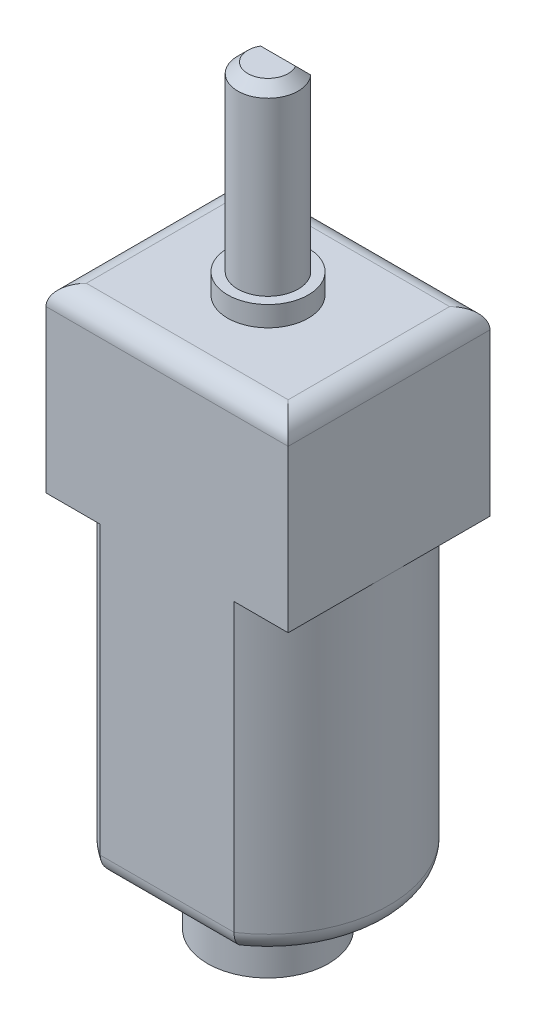
ISO-10303-21;
HEADER;
FILE_DESCRIPTION(('STEP AP214'),'2;1');
FILE_NAME('part.step','',(''),(''),'','','');
FILE_SCHEMA(('AUTOMOTIVE_DESIGN { 1 0 10303 214 1 1 1 1 }'));
ENDSEC;
DATA;
#1=APPLICATION_CONTEXT('core data for automotive mechanical design processes');
#2=APPLICATION_PROTOCOL_DEFINITION('international standard','automotive_design',2000,#1);
#3=PRODUCT_CONTEXT('',#1,'mechanical');
#4=PRODUCT('Part','Part','',(#3));
#5=PRODUCT_RELATED_PRODUCT_CATEGORY('part','',(#4));
#6=PRODUCT_DEFINITION_FORMATION('','',#4);
#7=PRODUCT_DEFINITION_CONTEXT('part definition',#1,'design');
#8=PRODUCT_DEFINITION('design','',#6,#7);
#9=PRODUCT_DEFINITION_SHAPE('','',#8);
#10=(LENGTH_UNIT() NAMED_UNIT(*) SI_UNIT(.MILLI.,.METRE.));
#11=(NAMED_UNIT(*) PLANE_ANGLE_UNIT() SI_UNIT($,.RADIAN.));
#12=(NAMED_UNIT(*) SI_UNIT($,.STERADIAN.) SOLID_ANGLE_UNIT());
#13=UNCERTAINTY_MEASURE_WITH_UNIT(LENGTH_MEASURE(1.E-05),#10,'distance_accuracy_value','');
#14=(GEOMETRIC_REPRESENTATION_CONTEXT(3) GLOBAL_UNCERTAINTY_ASSIGNED_CONTEXT((#13)) GLOBAL_UNIT_ASSIGNED_CONTEXT((#10,
#11,#12)) REPRESENTATION_CONTEXT('',''));
#15=CARTESIAN_POINT('',(0.,0.,0.));
#16=DIRECTION('',(0.,0.,1.));
#17=DIRECTION('',(1.,0.,0.));
#18=AXIS2_PLACEMENT_3D('',#15,#16,#17);
#19=CARTESIAN_POINT('',(0.,15.2,0.));
#20=DIRECTION('',(0.,-1.,0.));
#21=DIRECTION('',(0.,0.,-1.));
#22=AXIS2_PLACEMENT_3D('',#19,#20,#21);
#23=CYLINDRICAL_SURFACE('',#22,6.);
#24=DIRECTION('',(0.,-1.,0.));
#25=VECTOR('',#24,1.);
#26=CARTESIAN_POINT('',(-3.3166247903554,15.2,-5.));
#27=LINE('',#26,#25);
#28=CARTESIAN_POINT('',(-3.3166247903554,15.2,-5.));
#29=VERTEX_POINT('',#28);
#30=CARTESIAN_POINT('',(-3.3166247903554,1.,-5.));
#31=VERTEX_POINT('',#30);
#32=EDGE_CURVE('E240',#29,#31,#27,.T.);
#33=ORIENTED_EDGE('',*,*,#32,.T.);
#34=CARTESIAN_POINT('',(0.,0.999999999999999,0.));
#35=DIRECTION('',(0.,1.,0.));
#36=DIRECTION('',(0.,0.,1.));
#37=AXIS2_PLACEMENT_3D('',#34,#35,#36);
#38=CIRCLE('',#37,6.);
#39=CARTESIAN_POINT('',(-3.3166247903554,1.,5.));
#40=VERTEX_POINT('',#39);
#41=EDGE_CURVE('E473',#31,#40,#38,.T.);
#42=ORIENTED_EDGE('',*,*,#41,.T.);
#43=DIRECTION('',(0.,-1.,0.));
#44=VECTOR('',#43,1.);
#45=CARTESIAN_POINT('',(-3.3166247903554,15.2,5.));
#46=LINE('',#45,#44);
#47=CARTESIAN_POINT('',(-3.3166247903554,15.2,5.));
#48=VERTEX_POINT('',#47);
#49=EDGE_CURVE('E198',#48,#40,#46,.T.);
#50=ORIENTED_EDGE('',*,*,#49,.F.);
#51=CARTESIAN_POINT('',(0.,15.2,0.));
#52=DIRECTION('',(0.,1.,0.));
#53=DIRECTION('',(0.,0.,1.));
#54=AXIS2_PLACEMENT_3D('',#51,#52,#53);
#55=CIRCLE('',#54,6.);
#56=CARTESIAN_POINT('',(-6.,15.2,0.));
#57=VERTEX_POINT('',#56);
#58=EDGE_CURVE('E230',#57,#48,#55,.T.);
#59=ORIENTED_EDGE('',*,*,#58,.F.);
#60=EDGE_CURVE('E231',#29,#57,#55,.T.);
#61=ORIENTED_EDGE('',*,*,#60,.F.);
#62=EDGE_LOOP('',(#33,#42,#50,#59,#61));
#63=FACE_BOUND('',#62,.T.);
#64=ADVANCED_FACE('F40',(#63),#23,.T.);
#65=CARTESIAN_POINT('',(-3.3166247903554,15.2,5.));
#66=DIRECTION('',(0.,0.,-1.));
#67=DIRECTION('',(-1.,0.,0.));
#68=AXIS2_PLACEMENT_3D('',#65,#66,#67);
#69=PLANE('',#68);
#70=ORIENTED_EDGE('',*,*,#49,.T.);
#71=DIRECTION('',(1.,0.,0.));
#72=VECTOR('',#71,1.);
#73=CARTESIAN_POINT('',(-3.3166247903554,0.999999999999999,5.));
#74=LINE('',#73,#72);
#75=CARTESIAN_POINT('',(3.3166247903554,1.,5.));
#76=VERTEX_POINT('',#75);
#77=EDGE_CURVE('E446',#40,#76,#74,.T.);
#78=ORIENTED_EDGE('',*,*,#77,.T.);
#79=DIRECTION('',(0.,-1.,0.));
#80=VECTOR('',#79,1.);
#81=CARTESIAN_POINT('',(3.3166247903554,15.2,5.));
#82=LINE('',#81,#80);
#83=CARTESIAN_POINT('',(3.3166247903554,15.2,5.));
#84=VERTEX_POINT('',#83);
#85=EDGE_CURVE('E248',#84,#76,#82,.T.);
#86=ORIENTED_EDGE('',*,*,#85,.F.);
#87=DIRECTION('',(1.,0.,0.));
#88=VECTOR('',#87,1.);
#89=CARTESIAN_POINT('',(6.,15.2,5.));
#90=LINE('',#89,#88);
#91=CARTESIAN_POINT('',(6.,15.2,5.));
#92=VERTEX_POINT('',#91);
#93=EDGE_CURVE('E203',#84,#92,#90,.T.);
#94=ORIENTED_EDGE('',*,*,#93,.T.);
#95=DIRECTION('',(0.,-1.,0.));
#96=VECTOR('',#95,1.);
#97=CARTESIAN_POINT('',(6.,24.2,5.));
#98=LINE('',#97,#96);
#99=CARTESIAN_POINT('',(6.,23.2,5.));
#100=VERTEX_POINT('',#99);
#101=EDGE_CURVE('E224',#100,#92,#98,.T.);
#102=ORIENTED_EDGE('',*,*,#101,.F.);
#103=DIRECTION('',(1.,0.,0.));
#104=VECTOR('',#103,1.);
#105=CARTESIAN_POINT('',(-3.3166247903554,23.2,5.));
#106=LINE('',#105,#104);
#107=CARTESIAN_POINT('',(-6.,23.2,5.));
#108=VERTEX_POINT('',#107);
#109=EDGE_CURVE('E266',#100,#108,#106,.F.);
#110=ORIENTED_EDGE('',*,*,#109,.T.);
#111=DIRECTION('',(0.,-1.,0.));
#112=VECTOR('',#111,1.);
#113=CARTESIAN_POINT('',(-6.,24.2,5.));
#114=LINE('',#113,#112);
#115=CARTESIAN_POINT('',(-6.,15.2,5.));
#116=VERTEX_POINT('',#115);
#117=EDGE_CURVE('E227',#108,#116,#114,.T.);
#118=ORIENTED_EDGE('',*,*,#117,.T.);
#119=EDGE_CURVE('E204',#116,#48,#90,.T.);
#120=ORIENTED_EDGE('',*,*,#119,.T.);
#121=EDGE_LOOP('',(#70,#78,#86,#94,#102,#110,#118,#120));
#122=FACE_BOUND('',#121,.T.);
#123=ADVANCED_FACE('F346',(#122),#69,.F.);
#124=CARTESIAN_POINT('',(0.,15.2,0.));
#125=DIRECTION('',(0.,-1.,0.));
#126=DIRECTION('',(0.,0.,-1.));
#127=AXIS2_PLACEMENT_3D('',#124,#125,#126);
#128=CYLINDRICAL_SURFACE('',#127,6.);
#129=ORIENTED_EDGE('',*,*,#85,.T.);
#130=CARTESIAN_POINT('',(0.,0.999999999999999,0.));
#131=DIRECTION('',(0.,1.,0.));
#132=DIRECTION('',(0.,0.,1.));
#133=AXIS2_PLACEMENT_3D('',#130,#131,#132);
#134=CIRCLE('',#133,6.);
#135=CARTESIAN_POINT('',(3.3166247903554,1.,-5.));
#136=VERTEX_POINT('',#135);
#137=EDGE_CURVE('E459',#76,#136,#134,.T.);
#138=ORIENTED_EDGE('',*,*,#137,.T.);
#139=DIRECTION('',(0.,-1.,0.));
#140=VECTOR('',#139,1.);
#141=CARTESIAN_POINT('',(3.3166247903554,15.2,-5.));
#142=LINE('',#141,#140);
#143=CARTESIAN_POINT('',(3.3166247903554,15.2,-5.));
#144=VERTEX_POINT('',#143);
#145=EDGE_CURVE('E244',#144,#136,#142,.T.);
#146=ORIENTED_EDGE('',*,*,#145,.F.);
#147=CARTESIAN_POINT('',(0.,15.2,0.));
#148=DIRECTION('',(0.,1.,0.));
#149=DIRECTION('',(0.,0.,1.));
#150=AXIS2_PLACEMENT_3D('',#147,#148,#149);
#151=CIRCLE('',#150,6.);
#152=CARTESIAN_POINT('',(6.,15.2,0.));
#153=VERTEX_POINT('',#152);
#154=EDGE_CURVE('E235',#153,#144,#151,.T.);
#155=ORIENTED_EDGE('',*,*,#154,.F.);
#156=EDGE_CURVE('E236',#84,#153,#151,.T.);
#157=ORIENTED_EDGE('',*,*,#156,.F.);
#158=EDGE_LOOP('',(#129,#138,#146,#155,#157));
#159=FACE_BOUND('',#158,.T.);
#160=ADVANCED_FACE('F351',(#159),#128,.T.);
#161=CARTESIAN_POINT('',(-3.3166247903554,15.2,-5.));
#162=DIRECTION('',(0.,0.,1.));
#163=DIRECTION('',(1.,0.,0.));
#164=AXIS2_PLACEMENT_3D('',#161,#162,#163);
#165=PLANE('',#164);
#166=ORIENTED_EDGE('',*,*,#145,.T.);
#167=DIRECTION('',(-1.,0.,0.));
#168=VECTOR('',#167,1.);
#169=CARTESIAN_POINT('',(-3.3166247903554,0.999999999999999,-5.));
#170=LINE('',#169,#168);
#171=EDGE_CURVE('E471',#136,#31,#170,.T.);
#172=ORIENTED_EDGE('',*,*,#171,.T.);
#173=ORIENTED_EDGE('',*,*,#32,.F.);
#174=DIRECTION('',(-1.,0.,0.));
#175=VECTOR('',#174,1.);
#176=CARTESIAN_POINT('',(6.,15.2,-5.));
#177=LINE('',#176,#175);
#178=CARTESIAN_POINT('',(-6.,15.2,-5.));
#179=VERTEX_POINT('',#178);
#180=EDGE_CURVE('E213',#29,#179,#177,.T.);
#181=ORIENTED_EDGE('',*,*,#180,.T.);
#182=DIRECTION('',(0.,-1.,0.));
#183=VECTOR('',#182,1.);
#184=CARTESIAN_POINT('',(-6.,24.2,-5.));
#185=LINE('',#184,#183);
#186=CARTESIAN_POINT('',(-6.,23.2,-5.));
#187=VERTEX_POINT('',#186);
#188=EDGE_CURVE('E218',#187,#179,#185,.T.);
#189=ORIENTED_EDGE('',*,*,#188,.F.);
#190=DIRECTION('',(-1.,0.,0.));
#191=VECTOR('',#190,1.);
#192=CARTESIAN_POINT('',(-3.3166247903554,23.2,-5.));
#193=LINE('',#192,#191);
#194=CARTESIAN_POINT('',(6.,23.2,-5.));
#195=VERTEX_POINT('',#194);
#196=EDGE_CURVE('E463',#187,#195,#193,.F.);
#197=ORIENTED_EDGE('',*,*,#196,.T.);
#198=DIRECTION('',(0.,-1.,0.));
#199=VECTOR('',#198,1.);
#200=CARTESIAN_POINT('',(6.,24.2,-5.));
#201=LINE('',#200,#199);
#202=CARTESIAN_POINT('',(6.,15.2,-5.));
#203=VERTEX_POINT('',#202);
#204=EDGE_CURVE('E221',#195,#203,#201,.T.);
#205=ORIENTED_EDGE('',*,*,#204,.T.);
#206=EDGE_CURVE('E214',#203,#144,#177,.T.);
#207=ORIENTED_EDGE('',*,*,#206,.T.);
#208=EDGE_LOOP('',(#166,#172,#173,#181,#189,#197,#205,#207));
#209=FACE_BOUND('',#208,.T.);
#210=ADVANCED_FACE('F357',(#209),#165,.F.);
#211=CARTESIAN_POINT('',(0.,0.,0.));
#212=DIRECTION('',(0.,1.,0.));
#213=DIRECTION('',(0.,0.,1.));
#214=AXIS2_PLACEMENT_3D('',#211,#212,#213);
#215=PLANE('',#214);
#216=CARTESIAN_POINT('',(0.,0.,0.));
#217=DIRECTION('',(0.,1.,0.));
#218=DIRECTION('',(0.,0.,1.));
#219=AXIS2_PLACEMENT_3D('',#216,#217,#218);
#220=CIRCLE('',#219,3.);
#221=CARTESIAN_POINT('',(0.,0.,3.));
#222=VERTEX_POINT('',#221);
#223=EDGE_CURVE('E11',#222,#222,#220,.F.);
#224=ORIENTED_EDGE('',*,*,#223,.F.);
#225=EDGE_LOOP('',(#224));
#226=FACE_BOUND('',#225,.T.);
#227=CARTESIAN_POINT('',(0.,0.,0.));
#228=DIRECTION('',(0.,1.,0.));
#229=DIRECTION('',(0.,0.,1.));
#230=AXIS2_PLACEMENT_3D('',#227,#228,#229);
#231=CIRCLE('',#230,5.);
#232=CARTESIAN_POINT('',(3.,0.,-4.));
#233=VERTEX_POINT('',#232);
#234=CARTESIAN_POINT('',(3.,0.,4.));
#235=VERTEX_POINT('',#234);
#236=EDGE_CURVE('E458',#233,#235,#231,.F.);
#237=ORIENTED_EDGE('',*,*,#236,.T.);
#238=DIRECTION('',(1.,0.,0.));
#239=VECTOR('',#238,1.);
#240=CARTESIAN_POINT('',(0.,0.,4.));
#241=LINE('',#240,#239);
#242=CARTESIAN_POINT('',(-3.,0.,4.));
#243=VERTEX_POINT('',#242);
#244=EDGE_CURVE('E444',#235,#243,#241,.F.);
#245=ORIENTED_EDGE('',*,*,#244,.T.);
#246=CARTESIAN_POINT('',(0.,0.,0.));
#247=DIRECTION('',(0.,1.,0.));
#248=DIRECTION('',(0.,0.,1.));
#249=AXIS2_PLACEMENT_3D('',#246,#247,#248);
#250=CIRCLE('',#249,5.);
#251=CARTESIAN_POINT('',(-3.,0.,-4.));
#252=VERTEX_POINT('',#251);
#253=EDGE_CURVE('E450',#243,#252,#250,.F.);
#254=ORIENTED_EDGE('',*,*,#253,.T.);
#255=DIRECTION('',(-1.,0.,0.));
#256=VECTOR('',#255,1.);
#257=CARTESIAN_POINT('',(0.,0.,-4.));
#258=LINE('',#257,#256);
#259=EDGE_CURVE('E455',#252,#233,#258,.F.);
#260=ORIENTED_EDGE('',*,*,#259,.T.);
#261=EDGE_LOOP('',(#237,#245,#254,#260));
#262=FACE_BOUND('',#261,.T.);
#263=ADVANCED_FACE('F361',(#226,#262),#215,.F.);
#264=CARTESIAN_POINT('',(0.,15.2,0.));
#265=DIRECTION('',(0.,-1.,0.));
#266=DIRECTION('',(0.,0.,-1.));
#267=AXIS2_PLACEMENT_3D('',#264,#265,#266);
#268=PLANE('',#267);
#269=ORIENTED_EDGE('',*,*,#180,.F.);
#270=ORIENTED_EDGE('',*,*,#60,.T.);
#271=DIRECTION('',(0.,0.,1.));
#272=VECTOR('',#271,1.);
#273=CARTESIAN_POINT('',(-6.,15.2,-5.));
#274=LINE('',#273,#272);
#275=EDGE_CURVE('E199',#179,#57,#274,.T.);
#276=ORIENTED_EDGE('',*,*,#275,.F.);
#277=EDGE_LOOP('',(#269,#270,#276));
#278=FACE_BOUND('',#277,.T.);
#279=ADVANCED_FACE('F365',(#278),#268,.T.);
#280=EDGE_CURVE('E194',#57,#116,#274,.T.);
#281=ORIENTED_EDGE('',*,*,#280,.F.);
#282=ORIENTED_EDGE('',*,*,#58,.T.);
#283=ORIENTED_EDGE('',*,*,#119,.F.);
#284=EDGE_LOOP('',(#281,#282,#283));
#285=FACE_BOUND('',#284,.T.);
#286=ADVANCED_FACE('F524',(#285),#268,.T.);
#287=ORIENTED_EDGE('',*,*,#93,.F.);
#288=ORIENTED_EDGE('',*,*,#156,.T.);
#289=DIRECTION('',(0.,0.,-1.));
#290=VECTOR('',#289,1.);
#291=CARTESIAN_POINT('',(6.,15.2,-5.));
#292=LINE('',#291,#290);
#293=EDGE_CURVE('E209',#92,#153,#292,.T.);
#294=ORIENTED_EDGE('',*,*,#293,.F.);
#295=EDGE_LOOP('',(#287,#288,#294));
#296=FACE_BOUND('',#295,.T.);
#297=ADVANCED_FACE('F371',(#296),#268,.T.);
#298=CARTESIAN_POINT('',(-6.,24.2,-5.));
#299=DIRECTION('',(1.,0.,0.));
#300=DIRECTION('',(0.,0.,-1.));
#301=AXIS2_PLACEMENT_3D('',#298,#299,#300);
#302=PLANE('',#301);
#303=ORIENTED_EDGE('',*,*,#117,.F.);
#304=DIRECTION('',(0.,0.,1.));
#305=VECTOR('',#304,1.);
#306=CARTESIAN_POINT('',(-6.,23.2,-5.));
#307=LINE('',#306,#305);
#308=EDGE_CURVE('E487',#108,#187,#307,.F.);
#309=ORIENTED_EDGE('',*,*,#308,.T.);
#310=ORIENTED_EDGE('',*,*,#188,.T.);
#311=ORIENTED_EDGE('',*,*,#275,.T.);
#312=ORIENTED_EDGE('',*,*,#280,.T.);
#313=EDGE_LOOP('',(#303,#309,#310,#311,#312));
#314=FACE_BOUND('',#313,.T.);
#315=ADVANCED_FACE('F367',(#314),#302,.F.);
#316=CARTESIAN_POINT('',(6.,24.2,-5.));
#317=DIRECTION('',(-1.,0.,0.));
#318=DIRECTION('',(0.,0.,1.));
#319=AXIS2_PLACEMENT_3D('',#316,#317,#318);
#320=PLANE('',#319);
#321=ORIENTED_EDGE('',*,*,#204,.F.);
#322=DIRECTION('',(0.,0.,-1.));
#323=VECTOR('',#322,1.);
#324=CARTESIAN_POINT('',(6.,23.2,-5.));
#325=LINE('',#324,#323);
#326=EDGE_CURVE('E49',#195,#100,#325,.F.);
#327=ORIENTED_EDGE('',*,*,#326,.T.);
#328=ORIENTED_EDGE('',*,*,#101,.T.);
#329=ORIENTED_EDGE('',*,*,#293,.T.);
#330=EDGE_CURVE('E208',#153,#203,#292,.T.);
#331=ORIENTED_EDGE('',*,*,#330,.T.);
#332=EDGE_LOOP('',(#321,#327,#328,#329,#331));
#333=FACE_BOUND('',#332,.T.);
#334=ADVANCED_FACE('F370',(#333),#320,.F.);
#335=CARTESIAN_POINT('',(0.,24.2,0.));
#336=DIRECTION('',(0.,-1.,0.));
#337=DIRECTION('',(0.,0.,-1.));
#338=AXIS2_PLACEMENT_3D('',#335,#336,#337);
#339=PLANE('',#338);
#340=DIRECTION('',(0.,0.,-1.));
#341=VECTOR('',#340,1.);
#342=CARTESIAN_POINT('',(5.,24.2,0.));
#343=LINE('',#342,#341);
#344=CARTESIAN_POINT('',(5.,24.2,4.));
#345=VERTEX_POINT('',#344);
#346=CARTESIAN_POINT('',(5.,24.2,-4.));
#347=VERTEX_POINT('',#346);
#348=EDGE_CURVE('E476',#345,#347,#343,.T.);
#349=ORIENTED_EDGE('',*,*,#348,.T.);
#350=DIRECTION('',(-1.,0.,0.));
#351=VECTOR('',#350,1.);
#352=CARTESIAN_POINT('',(0.,24.2,-4.));
#353=LINE('',#352,#351);
#354=CARTESIAN_POINT('',(-5.,24.2,-4.));
#355=VERTEX_POINT('',#354);
#356=EDGE_CURVE('E484',#347,#355,#353,.T.);
#357=ORIENTED_EDGE('',*,*,#356,.T.);
#358=DIRECTION('',(0.,0.,1.));
#359=VECTOR('',#358,1.);
#360=CARTESIAN_POINT('',(-5.,24.2,0.));
#361=LINE('',#360,#359);
#362=CARTESIAN_POINT('',(-5.,24.2,4.));
#363=VERTEX_POINT('',#362);
#364=EDGE_CURVE('E63',#355,#363,#361,.T.);
#365=ORIENTED_EDGE('',*,*,#364,.T.);
#366=DIRECTION('',(1.,0.,0.));
#367=VECTOR('',#366,1.);
#368=CARTESIAN_POINT('',(0.,24.2,4.));
#369=LINE('',#368,#367);
#370=EDGE_CURVE('E479',#363,#345,#369,.T.);
#371=ORIENTED_EDGE('',*,*,#370,.T.);
#372=EDGE_LOOP('',(#349,#357,#365,#371));
#373=FACE_BOUND('',#372,.T.);
#374=CARTESIAN_POINT('',(0.,24.2,0.));
#375=DIRECTION('',(0.,1.,0.));
#376=DIRECTION('',(0.,0.,1.));
#377=AXIS2_PLACEMENT_3D('',#374,#375,#376);
#378=CIRCLE('',#377,2.);
#379=CARTESIAN_POINT('',(0.,24.2,2.));
#380=VERTEX_POINT('',#379);
#381=EDGE_CURVE('E190',#380,#380,#378,.T.);
#382=ORIENTED_EDGE('',*,*,#381,.F.);
#383=EDGE_LOOP('',(#382));
#384=FACE_BOUND('',#383,.T.);
#385=ADVANCED_FACE('F375',(#373,#384),#339,.F.);
#386=ORIENTED_EDGE('',*,*,#330,.F.);
#387=ORIENTED_EDGE('',*,*,#154,.T.);
#388=ORIENTED_EDGE('',*,*,#206,.F.);
#389=EDGE_LOOP('',(#386,#387,#388));
#390=FACE_BOUND('',#389,.T.);
#391=ADVANCED_FACE('F377',(#390),#268,.T.);
#392=CARTESIAN_POINT('',(0.,25.2,0.));
#393=DIRECTION('',(0.,-1.,0.));
#394=DIRECTION('',(0.,0.,-1.));
#395=AXIS2_PLACEMENT_3D('',#392,#393,#394);
#396=CYLINDRICAL_SURFACE('',#395,2.);
#397=CARTESIAN_POINT('',(0.,25.2,0.));
#398=DIRECTION('',(0.,1.,0.));
#399=DIRECTION('',(0.,0.,1.));
#400=AXIS2_PLACEMENT_3D('',#397,#398,#399);
#401=CIRCLE('',#400,2.);
#402=CARTESIAN_POINT('',(0.,25.2,2.));
#403=VERTEX_POINT('',#402);
#404=EDGE_CURVE('E182',#403,#403,#401,.T.);
#405=ORIENTED_EDGE('',*,*,#404,.F.);
#406=EDGE_LOOP('',(#405));
#407=FACE_BOUND('',#406,.T.);
#408=ORIENTED_EDGE('',*,*,#381,.T.);
#409=EDGE_LOOP('',(#408));
#410=FACE_BOUND('',#409,.T.);
#411=ADVANCED_FACE('F380',(#407,#410),#396,.T.);
#412=CARTESIAN_POINT('',(0.,25.2,0.));
#413=DIRECTION('',(0.,1.,0.));
#414=DIRECTION('',(0.,0.,1.));
#415=AXIS2_PLACEMENT_3D('',#412,#413,#414);
#416=PLANE('',#415);
#417=CARTESIAN_POINT('',(0.,25.2,0.));
#418=DIRECTION('',(0.,1.,0.));
#419=DIRECTION('',(0.,0.,1.));
#420=AXIS2_PLACEMENT_3D('',#417,#418,#419);
#421=CIRCLE('',#420,1.5);
#422=CARTESIAN_POINT('',(0.,25.2,1.5));
#423=VERTEX_POINT('',#422);
#424=EDGE_CURVE('E185',#423,#423,#421,.T.);
#425=ORIENTED_EDGE('',*,*,#424,.F.);
#426=EDGE_LOOP('',(#425));
#427=FACE_BOUND('',#426,.T.);
#428=ORIENTED_EDGE('',*,*,#404,.T.);
#429=EDGE_LOOP('',(#428));
#430=FACE_BOUND('',#429,.T.);
#431=ADVANCED_FACE('F386',(#427,#430),#416,.T.);
#432=CARTESIAN_POINT('',(0.,34.2,0.));
#433=DIRECTION('',(0.,-1.,0.));
#434=DIRECTION('',(0.,0.,-1.));
#435=AXIS2_PLACEMENT_3D('',#432,#433,#434);
#436=CYLINDRICAL_SURFACE('',#435,1.5);
#437=DIRECTION('',(0.,1.,0.));
#438=VECTOR('',#437,1.);
#439=CARTESIAN_POINT('',(1.11803398874989,26.2,-1.));
#440=LINE('',#439,#438);
#441=CARTESIAN_POINT('',(1.11803398874989,26.2,-1.));
#442=VERTEX_POINT('',#441);
#443=CARTESIAN_POINT('',(1.11803398874989,33.7,-1.));
#444=VERTEX_POINT('',#443);
#445=EDGE_CURVE('E170',#442,#444,#440,.T.);
#446=ORIENTED_EDGE('',*,*,#445,.T.);
#447=CARTESIAN_POINT('',(0.,33.7,0.));
#448=DIRECTION('',(0.,1.,0.));
#449=DIRECTION('',(0.,0.,1.));
#450=AXIS2_PLACEMENT_3D('',#447,#448,#449);
#451=CIRCLE('',#450,1.5);
#452=CARTESIAN_POINT('',(-1.11803398874989,33.7,-1.));
#453=VERTEX_POINT('',#452);
#454=EDGE_CURVE('E177',#444,#453,#451,.F.);
#455=ORIENTED_EDGE('',*,*,#454,.T.);
#456=DIRECTION('',(0.,1.,0.));
#457=VECTOR('',#456,1.);
#458=CARTESIAN_POINT('',(-1.11803398874989,26.2,-1.));
#459=LINE('',#458,#457);
#460=CARTESIAN_POINT('',(-1.11803398874989,26.2,-1.));
#461=VERTEX_POINT('',#460);
#462=EDGE_CURVE('E169',#461,#453,#459,.T.);
#463=ORIENTED_EDGE('',*,*,#462,.F.);
#464=CARTESIAN_POINT('',(0.,26.2,0.));
#465=DIRECTION('',(0.,1.,0.));
#466=DIRECTION('',(0.,0.,1.));
#467=AXIS2_PLACEMENT_3D('',#464,#465,#466);
#468=CIRCLE('',#467,1.5);
#469=EDGE_CURVE('E156',#442,#461,#468,.T.);
#470=ORIENTED_EDGE('',*,*,#469,.F.);
#471=EDGE_LOOP('',(#446,#455,#463,#470));
#472=FACE_BOUND('',#471,.T.);
#473=ORIENTED_EDGE('',*,*,#424,.T.);
#474=EDGE_LOOP('',(#473));
#475=FACE_BOUND('',#474,.T.);
#476=ADVANCED_FACE('F174',(#472,#475),#436,.T.);
#477=CARTESIAN_POINT('',(0.,34.2,0.));
#478=DIRECTION('',(0.,1.,0.));
#479=DIRECTION('',(0.,0.,1.));
#480=AXIS2_PLACEMENT_3D('',#477,#478,#479);
#481=PLANE('',#480);
#482=DIRECTION('',(-1.,0.,0.));
#483=VECTOR('',#482,1.);
#484=CARTESIAN_POINT('',(-1.1180339887499,34.2,-0.499999999999996));
#485=LINE('',#484,#483);
#486=CARTESIAN_POINT('',(0.866025403784437,34.2,-0.499999999999996));
#487=VERTEX_POINT('',#486);
#488=CARTESIAN_POINT('',(-0.866025403784437,34.2,-0.499999999999996));
#489=VERTEX_POINT('',#488);
#490=EDGE_CURVE('E189',#487,#489,#485,.T.);
#491=ORIENTED_EDGE('',*,*,#490,.T.);
#492=CARTESIAN_POINT('',(0.,34.2,0.));
#493=DIRECTION('',(0.,1.,0.));
#494=DIRECTION('',(0.,0.,1.));
#495=AXIS2_PLACEMENT_3D('',#492,#493,#494);
#496=CIRCLE('',#495,0.999999999999996);
#497=EDGE_CURVE('E257',#489,#487,#496,.T.);
#498=ORIENTED_EDGE('',*,*,#497,.T.);
#499=EDGE_LOOP('',(#491,#498));
#500=FACE_BOUND('',#499,.T.);
#501=ADVANCED_FACE('F393',(#500),#481,.T.);
#502=CARTESIAN_POINT('',(-1.11803398874989,26.2,-1.));
#503=DIRECTION('',(0.,0.,1.));
#504=DIRECTION('',(1.,0.,0.));
#505=AXIS2_PLACEMENT_3D('',#502,#503,#504);
#506=PLANE('',#505);
#507=ORIENTED_EDGE('',*,*,#462,.T.);
#508=DIRECTION('',(1.,0.,0.));
#509=VECTOR('',#508,1.);
#510=CARTESIAN_POINT('',(1.11803398874989,33.7,-1.));
#511=LINE('',#510,#509);
#512=EDGE_CURVE('E263',#453,#444,#511,.T.);
#513=ORIENTED_EDGE('',*,*,#512,.T.);
#514=ORIENTED_EDGE('',*,*,#445,.F.);
#515=DIRECTION('',(1.,0.,0.));
#516=VECTOR('',#515,1.);
#517=CARTESIAN_POINT('',(-1.11803398874989,26.2,-1.));
#518=LINE('',#517,#516);
#519=EDGE_CURVE('E159',#461,#442,#518,.T.);
#520=ORIENTED_EDGE('',*,*,#519,.F.);
#521=EDGE_LOOP('',(#507,#513,#514,#520));
#522=FACE_BOUND('',#521,.T.);
#523=ADVANCED_FACE('F168',(#522),#506,.F.);
#524=CARTESIAN_POINT('',(0.,26.2,0.));
#525=DIRECTION('',(0.,1.,0.));
#526=DIRECTION('',(0.,0.,1.));
#527=AXIS2_PLACEMENT_3D('',#524,#525,#526);
#528=PLANE('',#527);
#529=ORIENTED_EDGE('',*,*,#469,.T.);
#530=ORIENTED_EDGE('',*,*,#519,.T.);
#531=EDGE_LOOP('',(#529,#530));
#532=FACE_BOUND('',#531,.T.);
#533=ADVANCED_FACE('F158',(#532),#528,.T.);
#534=CARTESIAN_POINT('',(-1.11803398874989,33.7,-1.));
#535=DIRECTION('',(0.,0.707106781186545,-0.70710678118655));
#536=DIRECTION('',(-1.,0.,0.));
#537=AXIS2_PLACEMENT_3D('',#534,#535,#536);
#538=PLANE('',#537);
#539=CARTESIAN_POINT('',(0.866025403784437,34.2,-0.499999999999996));
#540=CARTESIAN_POINT('',(0.889670817230443,34.1590174890198,-0.540982510980232));
#541=CARTESIAN_POINT('',(0.912510658555563,34.1178077693964,-0.582192230603595));
#542=CARTESIAN_POINT('',(0.956798287943897,34.0350342590572,-0.664965740942796));
#543=CARTESIAN_POINT('',(0.978246633996499,33.9934706179226,-0.706529382077411));
#544=CARTESIAN_POINT('',(1.01998501215712,33.9100645267962,-0.789935473203841));
#545=CARTESIAN_POINT('',(1.04027526909828,33.8682221326954,-0.831777867304555));
#546=CARTESIAN_POINT('',(1.07986324730548,33.7842842017119,-0.915715798288136));
#547=CARTESIAN_POINT('',(1.09916056653034,33.7421885698791,-0.957811430120901));
#548=CARTESIAN_POINT('',(1.1180339887499,33.7,-1.));
#549=B_SPLINE_CURVE_WITH_KNOTS('',3,(#539,#540,#541,#542,#543,#544,#545,#546,#547,#548),
.UNSPECIFIED.,.F.,.F.,(4,2,2,2,4),(0.,0.187771729758158,0.375467691640897,0.563127089129874,
0.750861881583113),.UNSPECIFIED.);
#550=EDGE_CURVE('E267',#444,#487,#549,.F.);
#551=ORIENTED_EDGE('',*,*,#550,.F.);
#552=ORIENTED_EDGE('',*,*,#512,.F.);
#553=CARTESIAN_POINT('',(-1.11803398874989,33.7,-1.));
#554=CARTESIAN_POINT('',(-1.09916056653034,33.7421885698791,-0.9578114301209));
#555=CARTESIAN_POINT('',(-1.07986324730548,33.7842842017119,-0.915715798288135));
#556=CARTESIAN_POINT('',(-1.04027526909828,33.8682221326954,-0.831777867304555));
#557=CARTESIAN_POINT('',(-1.01998501215712,33.9100645267962,-0.789935473203841));
#558=CARTESIAN_POINT('',(-0.978246633996499,33.9934706179226,-0.706529382077411));
#559=CARTESIAN_POINT('',(-0.956798287943897,34.0350342590572,-0.664965740942795));
#560=CARTESIAN_POINT('',(-0.912510658555563,34.1178077693964,-0.582192230603595));
#561=CARTESIAN_POINT('',(-0.889670817230443,34.1590174890198,-0.540982510980231));
#562=CARTESIAN_POINT('',(-0.866025403784436,34.2,-0.499999999999995));
#563=B_SPLINE_CURVE_WITH_KNOTS('',3,(#553,#554,#555,#556,#557,#558,#559,#560,#561,#562),
.UNSPECIFIED.,.F.,.F.,(4,2,2,2,4),(0.,0.187734792453237,0.375394189942215,0.563090151824953,
0.750861881583112),.UNSPECIFIED.);
#564=EDGE_CURVE('E164',#489,#453,#563,.F.);
#565=ORIENTED_EDGE('',*,*,#564,.F.);
#566=ORIENTED_EDGE('',*,*,#490,.F.);
#567=EDGE_LOOP('',(#551,#552,#565,#566));
#568=FACE_BOUND('',#567,.T.);
#569=ADVANCED_FACE('F280',(#568),#538,.T.);
#570=CARTESIAN_POINT('',(0.,34.2,0.));
#571=DIRECTION('',(0.,-1.,0.));
#572=DIRECTION('',(0.,0.,-1.));
#573=AXIS2_PLACEMENT_3D('',#570,#571,#572);
#574=CONICAL_SURFACE('',#573,0.999999999999996,0.785398163397445);
#575=ORIENTED_EDGE('',*,*,#564,.T.);
#576=ORIENTED_EDGE('',*,*,#454,.F.);
#577=ORIENTED_EDGE('',*,*,#550,.T.);
#578=ORIENTED_EDGE('',*,*,#497,.F.);
#579=EDGE_LOOP('',(#575,#576,#577,#578));
#580=FACE_BOUND('',#579,.T.);
#581=ADVANCED_FACE('F283',(#580),#574,.T.);
#582=CARTESIAN_POINT('',(-3.3166247903554,0.999999999999999,-4.));
#583=DIRECTION('',(-1.,0.,0.));
#584=DIRECTION('',(0.,0.,1.));
#585=AXIS2_PLACEMENT_3D('',#582,#583,#584);
#586=CYLINDRICAL_SURFACE('',#585,1.);
#587=CARTESIAN_POINT('',(3.3166247903554,0.999999999999999,-5.));
#588=CARTESIAN_POINT('',(3.31662475103808,0.972754829844666,-5.00000041701742));
#589=CARTESIAN_POINT('',(3.31628886481328,0.945523005662864,-4.99888579988433));
#590=CARTESIAN_POINT('',(3.31494901956202,0.89126051758502,-4.99444316985175));
#591=CARTESIAN_POINT('',(3.31394514549975,0.864229828547843,-4.99111543844761));
#592=CARTESIAN_POINT('',(3.30994403977789,0.783835287022283,-4.9778609880578));
#593=CARTESIAN_POINT('',(3.30595727619554,0.731020387007066,-4.96466280524348));
#594=CARTESIAN_POINT('',(3.29545601999056,0.628474421586587,-4.93000157153718));
#595=CARTESIAN_POINT('',(3.28894129984341,0.578743634229153,-4.90853777671388));
#596=CARTESIAN_POINT('',(3.27356145236152,0.483659960271208,-4.85807281430431));
#597=CARTESIAN_POINT('',(3.26469611611437,0.438307463282795,-4.82907097677456));
#598=CARTESIAN_POINT('',(3.24467603925742,0.352390702124942,-4.76391048259002));
#599=CARTESIAN_POINT('',(3.23348484374422,0.311921254186885,-4.72763824010808));
#600=CARTESIAN_POINT('',(3.20919029279713,0.237620996208701,-4.64937748867151));
#601=CARTESIAN_POINT('',(3.19608632645455,0.203792315248759,-4.60738715373728));
#602=CARTESIAN_POINT('',(3.16771652373306,0.142269310576813,-4.51710944996796));
#603=CARTESIAN_POINT('',(3.15238459374233,0.114879171231154,-4.46863584261028));
#604=CARTESIAN_POINT('',(3.12036223072246,0.0686126787689437,-4.36820233837755));
#605=CARTESIAN_POINT('',(3.10367187018359,0.0497358717044744,-4.31624262755828));
#606=CARTESIAN_POINT('',(3.07297171173471,0.0238734133870755,-4.22148564913489));
#607=CARTESIAN_POINT('',(3.05914131811069,0.0152174114898533,-4.17907405595564));
#608=CARTESIAN_POINT('',(3.03109521138513,0.00346735662488168,-4.09367118973482));
#609=CARTESIAN_POINT('',(3.01688026362632,0.000362978239505338,-4.05068114297721));
#610=CARTESIAN_POINT('',(3.00172095607846,9.97614855027631E-06,-4.00516397232812));
#611=CARTESIAN_POINT('',(3.00086061743884,-2.53131964793859E-08,-4.00258184458489));
#612=CARTESIAN_POINT('',(3.,0.,-4.));
#613=B_SPLINE_CURVE_WITH_KNOTS('',3,(#587,#588,#589,#590,#591,#592,#593,#594,#595,#596,#597,
#598,#599,#600,#601,#602,#603,#604,#605,#606,#607,#608,#609,#610,#611,#612),.UNSPECIFIED.,.F.,
.F.,(4,2,2,2,2,2,2,2,2,2,2,2,4),(0.,0.0816842982620003,0.163358208739509,0.326266095070512,
0.489188647056449,0.65212568373704,0.817840611122268,0.983608581506803,1.15609492490195,
1.32857206989226,1.46458030813205,1.60033532167373,1.60850034267543),.UNSPECIFIED.);
#614=EDGE_CURVE('E308',#233,#136,#613,.F.);
#615=ORIENTED_EDGE('',*,*,#614,.F.);
#616=ORIENTED_EDGE('',*,*,#259,.F.);
#617=CARTESIAN_POINT('',(-3.3166247903554,0.999999999999999,-5.));
#618=CARTESIAN_POINT('',(-3.31662475103808,0.972754829844666,-5.00000041701742));
#619=CARTESIAN_POINT('',(-3.31628886481328,0.945523005662864,-4.99888579988433));
#620=CARTESIAN_POINT('',(-3.31494901956202,0.891260517585021,-4.99444316985175));
#621=CARTESIAN_POINT('',(-3.31394514549975,0.864229828547843,-4.99111543844761));
#622=CARTESIAN_POINT('',(-3.30994403977789,0.783835287022283,-4.9778609880578));
#623=CARTESIAN_POINT('',(-3.30595727619554,0.731020387007066,-4.96466280524348));
#624=CARTESIAN_POINT('',(-3.29545601999056,0.628474421586587,-4.93000157153718));
#625=CARTESIAN_POINT('',(-3.28894129984341,0.578743634229153,-4.90853777671388));
#626=CARTESIAN_POINT('',(-3.27356145236151,0.483659960271208,-4.85807281430431));
#627=CARTESIAN_POINT('',(-3.26469611611438,0.438307463282795,-4.82907097677456));
#628=CARTESIAN_POINT('',(-3.24467603925742,0.352390702124942,-4.76391048259003));
#629=CARTESIAN_POINT('',(-3.23348484374422,0.311921254186886,-4.72763824010808));
#630=CARTESIAN_POINT('',(-3.20919029279713,0.237620996208702,-4.64937748867151));
#631=CARTESIAN_POINT('',(-3.19608632645456,0.203792315248759,-4.60738715373728));
#632=CARTESIAN_POINT('',(-3.16771652373306,0.142269310576814,-4.51710944996796));
#633=CARTESIAN_POINT('',(-3.15238459374233,0.114879171231154,-4.46863584261028));
#634=CARTESIAN_POINT('',(-3.12036223072246,0.068612678768944,-4.36820233837755));
#635=CARTESIAN_POINT('',(-3.10367187018359,0.0497358717044744,-4.31624262755828));
#636=CARTESIAN_POINT('',(-3.07297171173471,0.0238734133870754,-4.22148564913489));
#637=CARTESIAN_POINT('',(-3.05914131811069,0.0152174114898534,-4.17907405595564));
#638=CARTESIAN_POINT('',(-3.03109521138513,0.0034673566248817,-4.09367118973482));
#639=CARTESIAN_POINT('',(-3.01688026362632,0.000362978239505183,-4.05068114297722));
#640=CARTESIAN_POINT('',(-3.00172095607846,9.97614855025815E-06,-4.00516397232812));
#641=CARTESIAN_POINT('',(-3.00086061743884,-2.53131964887035E-08,-4.00258184458489));
#642=CARTESIAN_POINT('',(-3.,0.,-4.));
#643=B_SPLINE_CURVE_WITH_KNOTS('',3,(#617,#618,#619,#620,#621,#622,#623,#624,#625,#626,#627,
#628,#629,#630,#631,#632,#633,#634,#635,#636,#637,#638,#639,#640,#641,#642),.UNSPECIFIED.,.F.,
.F.,(4,2,2,2,2,2,2,2,2,2,2,2,4),(0.,0.0816842982620001,0.163358208739509,0.326266095070511,
0.489188647056449,0.65212568373704,0.817840611122267,0.983608581506803,1.15609492490195,
1.32857206989226,1.46458030813205,1.60033532167373,1.60850034267543),.UNSPECIFIED.);
#644=EDGE_CURVE('E275',#31,#252,#643,.T.);
#645=ORIENTED_EDGE('',*,*,#644,.F.);
#646=ORIENTED_EDGE('',*,*,#171,.F.);
#647=EDGE_LOOP('',(#615,#616,#645,#646));
#648=FACE_BOUND('',#647,.T.);
#649=ADVANCED_FACE('F287',(#648),#586,.T.);
#650=CARTESIAN_POINT('',(0.,0.999999999999999,0.));
#651=DIRECTION('',(0.,1.,0.));
#652=DIRECTION('',(0.,0.,1.));
#653=AXIS2_PLACEMENT_3D('',#650,#651,#652);
#654=TOROIDAL_SURFACE('',#653,5.,1.);
#655=ORIENTED_EDGE('',*,*,#644,.T.);
#656=ORIENTED_EDGE('',*,*,#253,.F.);
#657=CARTESIAN_POINT('',(-3.3166247903554,0.999999999999999,5.));
#658=CARTESIAN_POINT('',(-3.31662475103808,0.972754829844666,5.00000041701742));
#659=CARTESIAN_POINT('',(-3.31628886481328,0.945523005662864,4.99888579988433));
#660=CARTESIAN_POINT('',(-3.31494901956202,0.891260517585021,4.99444316985175));
#661=CARTESIAN_POINT('',(-3.31394514549975,0.864229828547843,4.99111543844761));
#662=CARTESIAN_POINT('',(-3.30994403977789,0.783835287022283,4.9778609880578));
#663=CARTESIAN_POINT('',(-3.30595727619554,0.731020387007066,4.96466280524348));
#664=CARTESIAN_POINT('',(-3.29545601999056,0.628474421586587,4.93000157153718));
#665=CARTESIAN_POINT('',(-3.28894129984341,0.578743634229153,4.90853777671388));
#666=CARTESIAN_POINT('',(-3.27356145236151,0.483659960271208,4.85807281430431));
#667=CARTESIAN_POINT('',(-3.26469611611438,0.438307463282795,4.82907097677456));
#668=CARTESIAN_POINT('',(-3.24467603925742,0.352390702124942,4.76391048259003));
#669=CARTESIAN_POINT('',(-3.23348484374422,0.311921254186886,4.72763824010808));
#670=CARTESIAN_POINT('',(-3.20919029279713,0.237620996208702,4.64937748867151));
#671=CARTESIAN_POINT('',(-3.19608632645456,0.203792315248759,4.60738715373728));
#672=CARTESIAN_POINT('',(-3.16771652373306,0.142269310576814,4.51710944996796));
#673=CARTESIAN_POINT('',(-3.15238459374233,0.114879171231154,4.46863584261028));
#674=CARTESIAN_POINT('',(-3.12036223072246,0.068612678768944,4.36820233837755));
#675=CARTESIAN_POINT('',(-3.10367187018359,0.0497358717044744,4.31624262755828));
#676=CARTESIAN_POINT('',(-3.07297171173471,0.0238734133870754,4.22148564913489));
#677=CARTESIAN_POINT('',(-3.05914131811069,0.0152174114898534,4.17907405595564));
#678=CARTESIAN_POINT('',(-3.03109521138513,0.0034673566248817,4.09367118973482));
#679=CARTESIAN_POINT('',(-3.01688026362632,0.000362978239505183,4.05068114297722));
#680=CARTESIAN_POINT('',(-3.00172095607846,9.97614855025815E-06,4.00516397232812));
#681=CARTESIAN_POINT('',(-3.00086061743884,-2.53131964887035E-08,4.00258184458489));
#682=CARTESIAN_POINT('',(-3.,0.,4.));
#683=B_SPLINE_CURVE_WITH_KNOTS('',3,(#657,#658,#659,#660,#661,#662,#663,#664,#665,#666,#667,
#668,#669,#670,#671,#672,#673,#674,#675,#676,#677,#678,#679,#680,#681,#682),.UNSPECIFIED.,.F.,
.F.,(4,2,2,2,2,2,2,2,2,2,2,2,4),(0.,0.0816842982620001,0.163358208739509,0.326266095070511,
0.489188647056449,0.65212568373704,0.817840611122267,0.983608581506803,1.15609492490195,
1.32857206989226,1.46458030813205,1.60033532167373,1.60850034267543),.UNSPECIFIED.);
#684=EDGE_CURVE('E316',#40,#243,#683,.T.);
#685=ORIENTED_EDGE('',*,*,#684,.F.);
#686=ORIENTED_EDGE('',*,*,#41,.F.);
#687=EDGE_LOOP('',(#655,#656,#685,#686));
#688=FACE_BOUND('',#687,.T.);
#689=ADVANCED_FACE('F295',(#688),#654,.T.);
#690=CARTESIAN_POINT('',(0.,0.999999999999999,0.));
#691=DIRECTION('',(0.,1.,0.));
#692=DIRECTION('',(0.,0.,1.));
#693=AXIS2_PLACEMENT_3D('',#690,#691,#692);
#694=TOROIDAL_SURFACE('',#693,5.,1.);
#695=ORIENTED_EDGE('',*,*,#614,.T.);
#696=ORIENTED_EDGE('',*,*,#137,.F.);
#697=CARTESIAN_POINT('',(3.3166247903554,0.999999999999999,5.));
#698=CARTESIAN_POINT('',(3.31662475103808,0.972754829844666,5.00000041701742));
#699=CARTESIAN_POINT('',(3.31628886481328,0.945523005662864,4.99888579988433));
#700=CARTESIAN_POINT('',(3.31494901956202,0.891260517585021,4.99444316985175));
#701=CARTESIAN_POINT('',(3.31394514549975,0.864229828547843,4.99111543844761));
#702=CARTESIAN_POINT('',(3.30994403977789,0.783835287022283,4.9778609880578));
#703=CARTESIAN_POINT('',(3.30595727619554,0.731020387007066,4.96466280524348));
#704=CARTESIAN_POINT('',(3.29545601999056,0.628474421586587,4.93000157153718));
#705=CARTESIAN_POINT('',(3.28894129984341,0.578743634229153,4.90853777671388));
#706=CARTESIAN_POINT('',(3.27356145236151,0.483659960271208,4.85807281430431));
#707=CARTESIAN_POINT('',(3.26469611611438,0.438307463282795,4.82907097677456));
#708=CARTESIAN_POINT('',(3.24467603925742,0.352390702124942,4.76391048259003));
#709=CARTESIAN_POINT('',(3.23348484374422,0.311921254186886,4.72763824010808));
#710=CARTESIAN_POINT('',(3.20919029279713,0.237620996208702,4.64937748867151));
#711=CARTESIAN_POINT('',(3.19608632645456,0.203792315248759,4.60738715373728));
#712=CARTESIAN_POINT('',(3.16771652373306,0.142269310576814,4.51710944996796));
#713=CARTESIAN_POINT('',(3.15238459374233,0.114879171231154,4.46863584261028));
#714=CARTESIAN_POINT('',(3.12036223072246,0.068612678768944,4.36820233837755));
#715=CARTESIAN_POINT('',(3.10367187018359,0.0497358717044744,4.31624262755828));
#716=CARTESIAN_POINT('',(3.07297171173471,0.0238734133870754,4.22148564913489));
#717=CARTESIAN_POINT('',(3.05914131811069,0.0152174114898534,4.17907405595564));
#718=CARTESIAN_POINT('',(3.03109521138513,0.0034673566248817,4.09367118973482));
#719=CARTESIAN_POINT('',(3.01688026362632,0.000362978239505183,4.05068114297722));
#720=CARTESIAN_POINT('',(3.00172095607846,9.97614855025815E-06,4.00516397232812));
#721=CARTESIAN_POINT('',(3.00086061743884,-2.53131964887035E-08,4.00258184458489));
#722=CARTESIAN_POINT('',(3.,0.,4.));
#723=B_SPLINE_CURVE_WITH_KNOTS('',3,(#697,#698,#699,#700,#701,#702,#703,#704,#705,#706,#707,
#708,#709,#710,#711,#712,#713,#714,#715,#716,#717,#718,#719,#720,#721,#722),.UNSPECIFIED.,.F.,
.F.,(4,2,2,2,2,2,2,2,2,2,2,2,4),(0.,0.0816842982620001,0.163358208739509,0.326266095070511,
0.489188647056449,0.65212568373704,0.817840611122267,0.983608581506803,1.15609492490195,
1.32857206989226,1.46458030813205,1.60033532167373,1.60850034267543),.UNSPECIFIED.);
#724=EDGE_CURVE('E301',#235,#76,#723,.F.);
#725=ORIENTED_EDGE('',*,*,#724,.F.);
#726=ORIENTED_EDGE('',*,*,#236,.F.);
#727=EDGE_LOOP('',(#695,#696,#725,#726));
#728=FACE_BOUND('',#727,.T.);
#729=ADVANCED_FACE('F289',(#728),#694,.T.);
#730=CARTESIAN_POINT('',(-3.3166247903554,0.999999999999999,4.));
#731=DIRECTION('',(1.,0.,0.));
#732=DIRECTION('',(0.,0.,-1.));
#733=AXIS2_PLACEMENT_3D('',#730,#731,#732);
#734=CYLINDRICAL_SURFACE('',#733,1.);
#735=ORIENTED_EDGE('',*,*,#684,.T.);
#736=ORIENTED_EDGE('',*,*,#244,.F.);
#737=ORIENTED_EDGE('',*,*,#724,.T.);
#738=ORIENTED_EDGE('',*,*,#77,.F.);
#739=EDGE_LOOP('',(#735,#736,#737,#738));
#740=FACE_BOUND('',#739,.T.);
#741=ADVANCED_FACE('F294',(#740),#734,.T.);
#742=CARTESIAN_POINT('',(0.,23.2,4.));
#743=DIRECTION('',(1.,0.,0.));
#744=DIRECTION('',(0.,0.,-1.));
#745=AXIS2_PLACEMENT_3D('',#742,#743,#744);
#746=CYLINDRICAL_SURFACE('',#745,1.);
#747=CARTESIAN_POINT('',(-5.,23.2,4.));
#748=DIRECTION('',(0.707106781186547,0.,0.707106781186547));
#749=DIRECTION('',(0.707106781186547,0.,-0.707106781186548));
#750=AXIS2_PLACEMENT_3D('',#747,#748,#749);
#751=ELLIPSE('',#750,1.41421356237309,1.);
#752=EDGE_CURVE('E419',#108,#363,#751,.F.);
#753=ORIENTED_EDGE('',*,*,#752,.F.);
#754=ORIENTED_EDGE('',*,*,#109,.F.);
#755=CARTESIAN_POINT('',(5.,23.2,4.));
#756=DIRECTION('',(0.707106781186547,0.,-0.707106781186548));
#757=DIRECTION('',(-0.707106781186548,0.,-0.707106781186547));
#758=AXIS2_PLACEMENT_3D('',#755,#756,#757);
#759=ELLIPSE('',#758,1.4142135623731,1.);
#760=EDGE_CURVE('E424',#345,#100,#759,.T.);
#761=ORIENTED_EDGE('',*,*,#760,.F.);
#762=ORIENTED_EDGE('',*,*,#370,.F.);
#763=EDGE_LOOP('',(#753,#754,#761,#762));
#764=FACE_BOUND('',#763,.T.);
#765=ADVANCED_FACE('F42',(#764),#746,.T.);
#766=CARTESIAN_POINT('',(5.,23.2,0.));
#767=DIRECTION('',(0.,0.,-1.));
#768=DIRECTION('',(-1.,0.,0.));
#769=AXIS2_PLACEMENT_3D('',#766,#767,#768);
#770=CYLINDRICAL_SURFACE('',#769,1.);
#771=ORIENTED_EDGE('',*,*,#760,.T.);
#772=ORIENTED_EDGE('',*,*,#326,.F.);
#773=CARTESIAN_POINT('',(5.,23.2,-4.));
#774=DIRECTION('',(-0.707106781186548,0.,-0.707106781186547));
#775=DIRECTION('',(0.707106781186547,0.,-0.707106781186548));
#776=AXIS2_PLACEMENT_3D('',#773,#774,#775);
#777=ELLIPSE('',#776,1.41421356237309,1.);
#778=EDGE_CURVE('E416',#347,#195,#777,.T.);
#779=ORIENTED_EDGE('',*,*,#778,.F.);
#780=ORIENTED_EDGE('',*,*,#348,.F.);
#781=EDGE_LOOP('',(#771,#772,#779,#780));
#782=FACE_BOUND('',#781,.T.);
#783=ADVANCED_FACE('F336',(#782),#770,.T.);
#784=CARTESIAN_POINT('',(-5.,23.2,0.));
#785=DIRECTION('',(0.,0.,1.));
#786=DIRECTION('',(1.,0.,0.));
#787=AXIS2_PLACEMENT_3D('',#784,#785,#786);
#788=CYLINDRICAL_SURFACE('',#787,1.);
#789=ORIENTED_EDGE('',*,*,#752,.T.);
#790=ORIENTED_EDGE('',*,*,#364,.F.);
#791=CARTESIAN_POINT('',(-5.,23.2,-4.));
#792=DIRECTION('',(-0.707106781186547,0.,0.707106781186548));
#793=DIRECTION('',(0.707106781186547,0.,0.707106781186547));
#794=AXIS2_PLACEMENT_3D('',#791,#792,#793);
#795=ELLIPSE('',#794,1.4142135623731,1.);
#796=EDGE_CURVE('E56',#187,#355,#795,.F.);
#797=ORIENTED_EDGE('',*,*,#796,.F.);
#798=ORIENTED_EDGE('',*,*,#308,.F.);
#799=EDGE_LOOP('',(#789,#790,#797,#798));
#800=FACE_BOUND('',#799,.T.);
#801=ADVANCED_FACE('F334',(#800),#788,.T.);
#802=CARTESIAN_POINT('',(0.,23.2,-4.));
#803=DIRECTION('',(-1.,0.,0.));
#804=DIRECTION('',(0.,0.,1.));
#805=AXIS2_PLACEMENT_3D('',#802,#803,#804);
#806=CYLINDRICAL_SURFACE('',#805,1.);
#807=ORIENTED_EDGE('',*,*,#778,.T.);
#808=ORIENTED_EDGE('',*,*,#196,.F.);
#809=ORIENTED_EDGE('',*,*,#796,.T.);
#810=ORIENTED_EDGE('',*,*,#356,.F.);
#811=EDGE_LOOP('',(#807,#808,#809,#810));
#812=FACE_BOUND('',#811,.T.);
#813=ADVANCED_FACE('F329',(#812),#806,.T.);
#814=CARTESIAN_POINT('',(0.,-3.,0.));
#815=DIRECTION('',(0.,1.,0.));
#816=DIRECTION('',(0.,0.,1.));
#817=AXIS2_PLACEMENT_3D('',#814,#815,#816);
#818=CYLINDRICAL_SURFACE('',#817,3.);
#819=CARTESIAN_POINT('',(0.,-3.,0.));
#820=DIRECTION('',(0.,-1.,0.));
#821=DIRECTION('',(0.,0.,-1.));
#822=AXIS2_PLACEMENT_3D('',#819,#820,#821);
#823=CIRCLE('',#822,3.);
#824=CARTESIAN_POINT('',(0.,-3.,-3.));
#825=VERTEX_POINT('',#824);
#826=EDGE_CURVE('E411',#825,#825,#823,.T.);
#827=ORIENTED_EDGE('',*,*,#826,.F.);
#828=EDGE_LOOP('',(#827));
#829=FACE_BOUND('',#828,.T.);
#830=ORIENTED_EDGE('',*,*,#223,.T.);
#831=EDGE_LOOP('',(#830));
#832=FACE_BOUND('',#831,.T.);
#833=ADVANCED_FACE('F333',(#829,#832),#818,.T.);
#834=CARTESIAN_POINT('',(0.,-3.,0.));
#835=DIRECTION('',(0.,-1.,0.));
#836=DIRECTION('',(0.,0.,-1.));
#837=AXIS2_PLACEMENT_3D('',#834,#835,#836);
#838=PLANE('',#837);
#839=ORIENTED_EDGE('',*,*,#826,.T.);
#840=EDGE_LOOP('',(#839));
#841=FACE_BOUND('',#840,.T.);
#842=ADVANCED_FACE('F403',(#841),#838,.T.);
#843=CLOSED_SHELL('',(#64,#123,#160,#210,#263,#279,#286,#297,#315,#334,#385,#391,#411,#431,#476,
#501,#523,#533,#569,#581,#649,#689,#729,#741,#765,#783,#801,#813,#833,#842));
#844=MANIFOLD_SOLID_BREP('B2',#843);
#845=ADVANCED_BREP_SHAPE_REPRESENTATION('',(#18,#844),#14);
#846=SHAPE_DEFINITION_REPRESENTATION(#9,#845);
ENDSEC;
END-ISO-10303-21;
